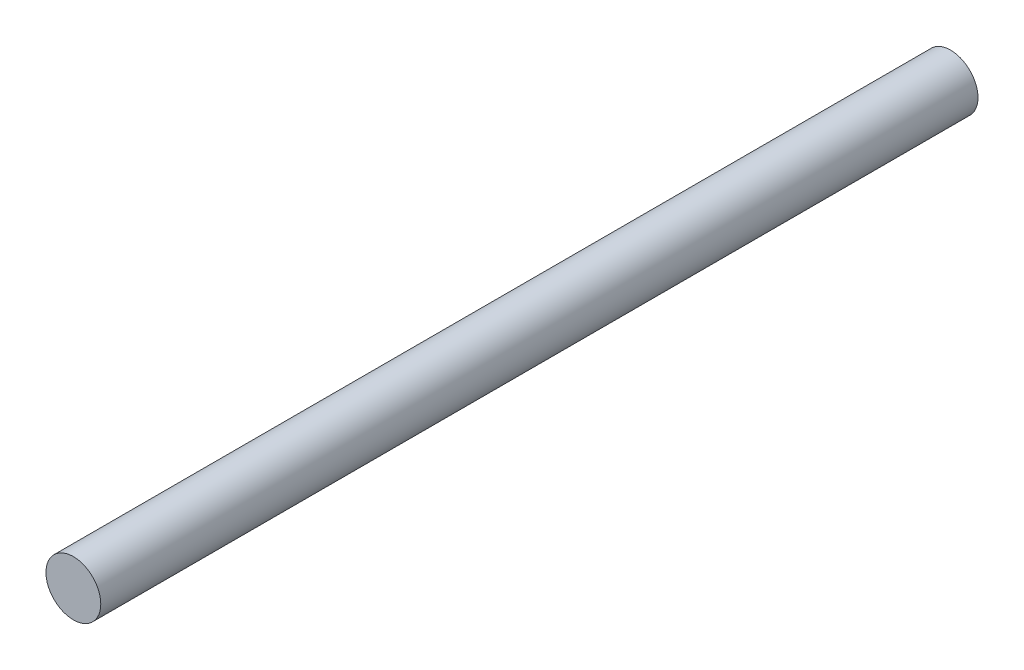
ISO-10303-21;
HEADER;
FILE_DESCRIPTION(('STEP AP214'),'2;1');
FILE_NAME('part.step','',(''),(''),'','','');
FILE_SCHEMA(('AUTOMOTIVE_DESIGN { 1 0 10303 214 1 1 1 1 }'));
ENDSEC;
DATA;
#1=APPLICATION_CONTEXT('core data for automotive mechanical design processes');
#2=APPLICATION_PROTOCOL_DEFINITION('international standard','automotive_design',2000,#1);
#3=PRODUCT_CONTEXT('',#1,'mechanical');
#4=PRODUCT('Part','Part','',(#3));
#5=PRODUCT_RELATED_PRODUCT_CATEGORY('part','',(#4));
#6=PRODUCT_DEFINITION_FORMATION('','',#4);
#7=PRODUCT_DEFINITION_CONTEXT('part definition',#1,'design');
#8=PRODUCT_DEFINITION('design','',#6,#7);
#9=PRODUCT_DEFINITION_SHAPE('','',#8);
#10=(LENGTH_UNIT() NAMED_UNIT(*) SI_UNIT(.MILLI.,.METRE.));
#11=(NAMED_UNIT(*) PLANE_ANGLE_UNIT() SI_UNIT($,.RADIAN.));
#12=(NAMED_UNIT(*) SI_UNIT($,.STERADIAN.) SOLID_ANGLE_UNIT());
#13=UNCERTAINTY_MEASURE_WITH_UNIT(LENGTH_MEASURE(1.E-05),#10,'distance_accuracy_value','');
#14=(GEOMETRIC_REPRESENTATION_CONTEXT(3) GLOBAL_UNCERTAINTY_ASSIGNED_CONTEXT((#13)) GLOBAL_UNIT_ASSIGNED_CONTEXT((#10,
#11,#12)) REPRESENTATION_CONTEXT('',''));
#15=CARTESIAN_POINT('',(0.,0.,0.));
#16=DIRECTION('',(0.,0.,1.));
#17=DIRECTION('',(1.,0.,0.));
#18=AXIS2_PLACEMENT_3D('',#15,#16,#17);
#19=CARTESIAN_POINT('',(0.,0.,609.6));
#20=DIRECTION('',(0.,0.,-1.));
#21=DIRECTION('',(-1.,0.,0.));
#22=AXIS2_PLACEMENT_3D('',#19,#20,#21);
#23=CYLINDRICAL_SURFACE('',#22,19.05);
#24=CARTESIAN_POINT('',(0.,0.,609.6));
#25=DIRECTION('',(0.,0.,1.));
#26=DIRECTION('',(1.,0.,0.));
#27=AXIS2_PLACEMENT_3D('',#24,#25,#26);
#28=CIRCLE('',#27,19.05);
#29=CARTESIAN_POINT('',(19.05,0.,609.6));
#30=VERTEX_POINT('',#29);
#31=EDGE_CURVE('E11',#30,#30,#28,.T.);
#32=ORIENTED_EDGE('',*,*,#31,.F.);
#33=EDGE_LOOP('',(#32));
#34=FACE_BOUND('',#33,.T.);
#35=DIRECTION('',(0.,-1.,0.));
#36=VECTOR('',#35,1.);
#37=CARTESIAN_POINT('',(-19.05,0.,50.8));
#38=LINE('',#37,#36);
#39=CARTESIAN_POINT('',(-19.05,0.,50.8));
#40=VERTEX_POINT('',#39);
#41=CARTESIAN_POINT('',(-19.05,-0.000500000000000066,50.8));
#42=VERTEX_POINT('',#41);
#43=EDGE_CURVE('E132',#40,#42,#38,.T.);
#44=ORIENTED_EDGE('',*,*,#43,.T.);
#45=DIRECTION('',(0.,0.,-1.));
#46=VECTOR('',#45,1.);
#47=CARTESIAN_POINT('',(-19.05,-0.000500000000000066,50.8));
#48=LINE('',#47,#46);
#49=CARTESIAN_POINT('',(-19.05,-0.000500000000000066,0.));
#50=VERTEX_POINT('',#49);
#51=EDGE_CURVE('E137',#42,#50,#48,.T.);
#52=ORIENTED_EDGE('',*,*,#51,.T.);
#53=CARTESIAN_POINT('',(0.,0.,0.));
#54=DIRECTION('',(0.,0.,1.));
#55=DIRECTION('',(1.,0.,0.));
#56=AXIS2_PLACEMENT_3D('',#53,#54,#55);
#57=CIRCLE('',#56,19.05);
#58=CARTESIAN_POINT('',(19.05,-0.000500000000000066,0.));
#59=VERTEX_POINT('',#58);
#60=EDGE_CURVE('E40',#50,#59,#57,.T.);
#61=ORIENTED_EDGE('',*,*,#60,.T.);
#62=DIRECTION('',(0.,0.,-1.));
#63=VECTOR('',#62,1.);
#64=CARTESIAN_POINT('',(19.05,-0.000500000000000066,50.8));
#65=LINE('',#64,#63);
#66=CARTESIAN_POINT('',(19.05,-0.000500000000000066,50.8));
#67=VERTEX_POINT('',#66);
#68=EDGE_CURVE('E107',#67,#59,#65,.T.);
#69=ORIENTED_EDGE('',*,*,#68,.F.);
#70=DIRECTION('',(0.,-1.,0.));
#71=VECTOR('',#70,1.);
#72=CARTESIAN_POINT('',(19.05,0.,50.8));
#73=LINE('',#72,#71);
#74=CARTESIAN_POINT('',(19.05,0.,50.8));
#75=VERTEX_POINT('',#74);
#76=EDGE_CURVE('E102',#75,#67,#73,.T.);
#77=ORIENTED_EDGE('',*,*,#76,.F.);
#78=CARTESIAN_POINT('',(0.,0.,50.8));
#79=DIRECTION('',(0.,0.,-1.));
#80=DIRECTION('',(-1.,0.,0.));
#81=AXIS2_PLACEMENT_3D('',#78,#79,#80);
#82=CIRCLE('',#81,19.05);
#83=CARTESIAN_POINT('',(19.0499999934383,0.000499999999827844,50.8));
#84=VERTEX_POINT('',#83);
#85=EDGE_CURVE('E96',#84,#75,#82,.T.);
#86=ORIENTED_EDGE('',*,*,#85,.F.);
#87=DIRECTION('',(0.,0.,-1.));
#88=VECTOR('',#87,1.);
#89=CARTESIAN_POINT('',(19.0499999934383,0.000499999999827844,50.8));
#90=LINE('',#89,#88);
#91=CARTESIAN_POINT('',(19.0499999934383,0.000499999999827844,0.));
#92=VERTEX_POINT('',#91);
#93=EDGE_CURVE('E84',#84,#92,#90,.T.);
#94=ORIENTED_EDGE('',*,*,#93,.T.);
#95=CARTESIAN_POINT('',(-19.0499999934383,0.000500000000000066,0.));
#96=VERTEX_POINT('',#95);
#97=EDGE_CURVE('E46',#92,#96,#57,.T.);
#98=ORIENTED_EDGE('',*,*,#97,.T.);
#99=DIRECTION('',(0.,0.,-1.));
#100=VECTOR('',#99,1.);
#101=CARTESIAN_POINT('',(-19.0499999934383,0.000500000000000066,50.8));
#102=LINE('',#101,#100);
#103=CARTESIAN_POINT('',(-19.0499999934383,0.000500000000000066,50.8));
#104=VERTEX_POINT('',#103);
#105=EDGE_CURVE('E90',#104,#96,#102,.T.);
#106=ORIENTED_EDGE('',*,*,#105,.F.);
#107=EDGE_CURVE('E91',#40,#104,#82,.T.);
#108=ORIENTED_EDGE('',*,*,#107,.F.);
#109=EDGE_LOOP('',(#44,#52,#61,#69,#77,#86,#94,#98,#106,#108));
#110=FACE_BOUND('',#109,.T.);
#111=ADVANCED_FACE('F37',(#34,#110),#23,.T.);
#112=CARTESIAN_POINT('',(0.,0.,0.));
#113=DIRECTION('',(0.,0.,1.));
#114=DIRECTION('',(1.,0.,0.));
#115=AXIS2_PLACEMENT_3D('',#112,#113,#114);
#116=PLANE('',#115);
#117=DIRECTION('',(-1.,0.,0.));
#118=VECTOR('',#117,1.);
#119=CARTESIAN_POINT('',(0.,0.000500000000000066,0.));
#120=LINE('',#119,#118);
#121=EDGE_CURVE('E64',#92,#96,#120,.T.);
#122=ORIENTED_EDGE('',*,*,#121,.T.);
#123=ORIENTED_EDGE('',*,*,#97,.F.);
#124=EDGE_LOOP('',(#122,#123));
#125=FACE_BOUND('',#124,.T.);
#126=ADVANCED_FACE('F112',(#125),#116,.F.);
#127=CARTESIAN_POINT('',(0.,0.,609.6));
#128=DIRECTION('',(0.,0.,1.));
#129=DIRECTION('',(1.,0.,0.));
#130=AXIS2_PLACEMENT_3D('',#127,#128,#129);
#131=PLANE('',#130);
#132=ORIENTED_EDGE('',*,*,#31,.T.);
#133=EDGE_LOOP('',(#132));
#134=FACE_BOUND('',#133,.T.);
#135=ADVANCED_FACE('F114',(#134),#131,.T.);
#136=ORIENTED_EDGE('',*,*,#60,.F.);
#137=DIRECTION('',(-1.,0.,0.));
#138=VECTOR('',#137,1.);
#139=CARTESIAN_POINT('',(19.05,-0.000500000000000066,0.));
#140=LINE('',#139,#138);
#141=EDGE_CURVE('E130',#59,#50,#140,.T.);
#142=ORIENTED_EDGE('',*,*,#141,.F.);
#143=EDGE_LOOP('',(#136,#142));
#144=FACE_BOUND('',#143,.T.);
#145=ADVANCED_FACE('F115',(#144),#116,.F.);
#146=CARTESIAN_POINT('',(0.,0.000500000000000066,50.8));
#147=DIRECTION('',(0.,-1.,0.));
#148=DIRECTION('',(0.,0.,-1.));
#149=AXIS2_PLACEMENT_3D('',#146,#147,#148);
#150=PLANE('',#149);
#151=ORIENTED_EDGE('',*,*,#121,.F.);
#152=ORIENTED_EDGE('',*,*,#93,.F.);
#153=DIRECTION('',(-1.,0.,0.));
#154=VECTOR('',#153,1.);
#155=CARTESIAN_POINT('',(0.,0.000500000000000066,50.8));
#156=LINE('',#155,#154);
#157=EDGE_CURVE('E54',#84,#104,#156,.T.);
#158=ORIENTED_EDGE('',*,*,#157,.T.);
#159=ORIENTED_EDGE('',*,*,#105,.T.);
#160=EDGE_LOOP('',(#151,#152,#158,#159));
#161=FACE_BOUND('',#160,.T.);
#162=ADVANCED_FACE('F85',(#161),#150,.T.);
#163=CARTESIAN_POINT('',(0.,0.,50.8));
#164=DIRECTION('',(0.,0.,-1.));
#165=DIRECTION('',(-1.,0.,0.));
#166=AXIS2_PLACEMENT_3D('',#163,#164,#165);
#167=PLANE('',#166);
#168=ORIENTED_EDGE('',*,*,#157,.F.);
#169=ORIENTED_EDGE('',*,*,#85,.T.);
#170=ORIENTED_EDGE('',*,*,#76,.T.);
#171=DIRECTION('',(-1.,0.,0.));
#172=VECTOR('',#171,1.);
#173=CARTESIAN_POINT('',(19.05,-0.000500000000000066,50.8));
#174=LINE('',#173,#172);
#175=EDGE_CURVE('E73',#67,#42,#174,.T.);
#176=ORIENTED_EDGE('',*,*,#175,.T.);
#177=ORIENTED_EDGE('',*,*,#43,.F.);
#178=ORIENTED_EDGE('',*,*,#107,.T.);
#179=EDGE_LOOP('',(#168,#169,#170,#176,#177,#178));
#180=FACE_BOUND('',#179,.T.);
#181=ADVANCED_FACE('F95',(#180),#167,.T.);
#182=CARTESIAN_POINT('',(19.05,-0.000500000000000066,50.8));
#183=DIRECTION('',(0.,-1.,0.));
#184=DIRECTION('',(0.,0.,-1.));
#185=AXIS2_PLACEMENT_3D('',#182,#183,#184);
#186=PLANE('',#185);
#187=ORIENTED_EDGE('',*,*,#141,.T.);
#188=ORIENTED_EDGE('',*,*,#51,.F.);
#189=ORIENTED_EDGE('',*,*,#175,.F.);
#190=ORIENTED_EDGE('',*,*,#68,.T.);
#191=EDGE_LOOP('',(#187,#188,#189,#190));
#192=FACE_BOUND('',#191,.T.);
#193=ADVANCED_FACE('F138',(#192),#186,.F.);
#194=CLOSED_SHELL('',(#111,#126,#135,#145,#162,#181,#193));
#195=MANIFOLD_SOLID_BREP('B2',#194);
#196=ADVANCED_BREP_SHAPE_REPRESENTATION('',(#18,#195),#14);
#197=SHAPE_DEFINITION_REPRESENTATION(#9,#196);
ENDSEC;
END-ISO-10303-21;
